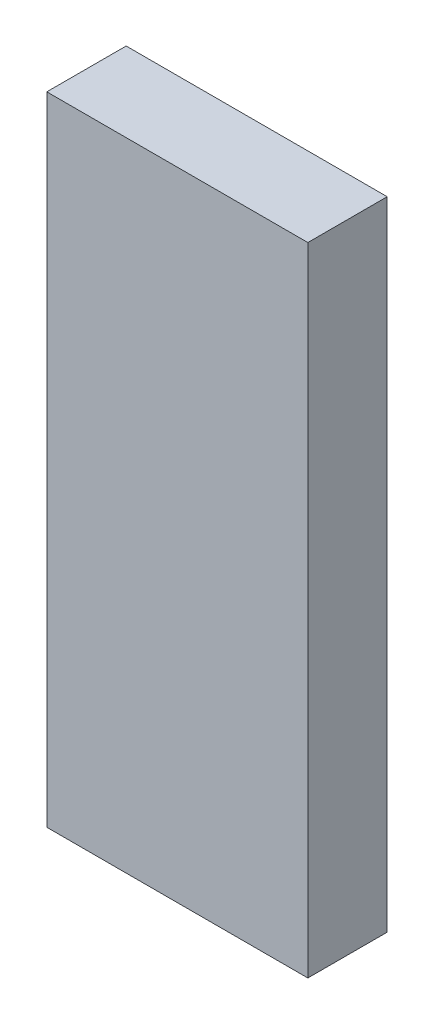
ISO-10303-21;
HEADER;
FILE_DESCRIPTION(('STEP AP214'),'2;1');
FILE_NAME('part.step','',(''),(''),'','','');
FILE_SCHEMA(('AUTOMOTIVE_DESIGN { 1 0 10303 214 1 1 1 1 }'));
ENDSEC;
DATA;
#1=APPLICATION_CONTEXT('core data for automotive mechanical design processes');
#2=APPLICATION_PROTOCOL_DEFINITION('international standard','automotive_design',2000,#1);
#3=PRODUCT_CONTEXT('',#1,'mechanical');
#4=PRODUCT('Part','Part','',(#3));
#5=PRODUCT_RELATED_PRODUCT_CATEGORY('part','',(#4));
#6=PRODUCT_DEFINITION_FORMATION('','',#4);
#7=PRODUCT_DEFINITION_CONTEXT('part definition',#1,'design');
#8=PRODUCT_DEFINITION('design','',#6,#7);
#9=PRODUCT_DEFINITION_SHAPE('','',#8);
#10=(LENGTH_UNIT() NAMED_UNIT(*) SI_UNIT(.MILLI.,.METRE.));
#11=(NAMED_UNIT(*) PLANE_ANGLE_UNIT() SI_UNIT($,.RADIAN.));
#12=(NAMED_UNIT(*) SI_UNIT($,.STERADIAN.) SOLID_ANGLE_UNIT());
#13=UNCERTAINTY_MEASURE_WITH_UNIT(LENGTH_MEASURE(1.E-05),#10,'distance_accuracy_value','');
#14=(GEOMETRIC_REPRESENTATION_CONTEXT(3) GLOBAL_UNCERTAINTY_ASSIGNED_CONTEXT((#13)) GLOBAL_UNIT_ASSIGNED_CONTEXT((#10,
#11,#12)) REPRESENTATION_CONTEXT('',''));
#15=CARTESIAN_POINT('',(0.,0.,0.));
#16=DIRECTION('',(0.,0.,1.));
#17=DIRECTION('',(1.,0.,0.));
#18=AXIS2_PLACEMENT_3D('',#15,#16,#17);
#19=CARTESIAN_POINT('',(0.62500002,1.52500076,0.38000178));
#20=DIRECTION('',(0.,0.,1.));
#21=DIRECTION('',(1.,0.,0.));
#22=AXIS2_PLACEMENT_3D('',#19,#20,#21);
#23=PLANE('',#22);
#24=DIRECTION('',(1.,0.,0.));
#25=VECTOR('',#24,1.);
#26=CARTESIAN_POINT('',(-0.62500002,1.52500076,0.38000178));
#27=LINE('',#26,#25);
#28=CARTESIAN_POINT('',(-0.62500002,1.52500076,0.38000178));
#29=VERTEX_POINT('',#28);
#30=CARTESIAN_POINT('',(0.62500002,1.52500076,0.38000178));
#31=VERTEX_POINT('',#30);
#32=EDGE_CURVE('E27',#29,#31,#27,.T.);
#33=ORIENTED_EDGE('',*,*,#32,.F.);
#34=DIRECTION('',(0.,1.,0.));
#35=VECTOR('',#34,1.);
#36=CARTESIAN_POINT('',(-0.62500002,-1.52499822,0.38000178));
#37=LINE('',#36,#35);
#38=CARTESIAN_POINT('',(-0.62500002,-1.52499822,0.38000178));
#39=VERTEX_POINT('',#38);
#40=EDGE_CURVE('E68',#39,#29,#37,.T.);
#41=ORIENTED_EDGE('',*,*,#40,.F.);
#42=DIRECTION('',(-1.,0.,0.));
#43=VECTOR('',#42,1.);
#44=CARTESIAN_POINT('',(0.62500002,-1.52499822,0.38000178));
#45=LINE('',#44,#43);
#46=CARTESIAN_POINT('',(0.62500002,-1.52499822,0.38000178));
#47=VERTEX_POINT('',#46);
#48=EDGE_CURVE('E71',#47,#39,#45,.T.);
#49=ORIENTED_EDGE('',*,*,#48,.F.);
#50=DIRECTION('',(0.,-1.,0.));
#51=VECTOR('',#50,1.);
#52=CARTESIAN_POINT('',(0.62500002,1.52500076,0.38000178));
#53=LINE('',#52,#51);
#54=EDGE_CURVE('E100',#31,#47,#53,.T.);
#55=ORIENTED_EDGE('',*,*,#54,.F.);
#56=EDGE_LOOP('',(#33,#41,#49,#55));
#57=FACE_BOUND('',#56,.T.);
#58=ADVANCED_FACE('F16',(#57),#23,.T.);
#59=CARTESIAN_POINT('',(0.62500002,1.52500076,0.));
#60=DIRECTION('',(0.,0.,1.));
#61=DIRECTION('',(1.,0.,0.));
#62=AXIS2_PLACEMENT_3D('',#59,#60,#61);
#63=PLANE('',#62);
#64=DIRECTION('',(0.,-1.,0.));
#65=VECTOR('',#64,1.);
#66=CARTESIAN_POINT('',(0.62500002,1.52500076,0.));
#67=LINE('',#66,#65);
#68=CARTESIAN_POINT('',(0.62500002,1.52500076,0.));
#69=VERTEX_POINT('',#68);
#70=CARTESIAN_POINT('',(0.62500002,-1.52499822,0.));
#71=VERTEX_POINT('',#70);
#72=EDGE_CURVE('E87',#69,#71,#67,.T.);
#73=ORIENTED_EDGE('',*,*,#72,.T.);
#74=DIRECTION('',(-1.,0.,0.));
#75=VECTOR('',#74,1.);
#76=CARTESIAN_POINT('',(0.62500002,-1.52499822,0.));
#77=LINE('',#76,#75);
#78=CARTESIAN_POINT('',(-0.62500002,-1.52499822,0.));
#79=VERTEX_POINT('',#78);
#80=EDGE_CURVE('E76',#71,#79,#77,.T.);
#81=ORIENTED_EDGE('',*,*,#80,.T.);
#82=DIRECTION('',(0.,1.,0.));
#83=VECTOR('',#82,1.);
#84=CARTESIAN_POINT('',(-0.62500002,-1.52499822,0.));
#85=LINE('',#84,#83);
#86=CARTESIAN_POINT('',(-0.62500002,1.52500076,0.));
#87=VERTEX_POINT('',#86);
#88=EDGE_CURVE('E20',#79,#87,#85,.T.);
#89=ORIENTED_EDGE('',*,*,#88,.T.);
#90=DIRECTION('',(1.,0.,0.));
#91=VECTOR('',#90,1.);
#92=CARTESIAN_POINT('',(-0.62500002,1.52500076,0.));
#93=LINE('',#92,#91);
#94=EDGE_CURVE('E10',#87,#69,#93,.T.);
#95=ORIENTED_EDGE('',*,*,#94,.T.);
#96=EDGE_LOOP('',(#73,#81,#89,#95));
#97=FACE_BOUND('',#96,.T.);
#98=ADVANCED_FACE('F122',(#97),#63,.F.);
#99=CARTESIAN_POINT('',(-0.62500002,1.52500076,0.));
#100=DIRECTION('',(0.,1.,0.));
#101=DIRECTION('',(1.,0.,0.));
#102=AXIS2_PLACEMENT_3D('',#99,#100,#101);
#103=PLANE('',#102);
#104=DIRECTION('',(0.,0.,1.));
#105=VECTOR('',#104,1.);
#106=CARTESIAN_POINT('',(-0.62500002,1.52500076,0.));
#107=LINE('',#106,#105);
#108=EDGE_CURVE('E75',#87,#29,#107,.T.);
#109=ORIENTED_EDGE('',*,*,#108,.T.);
#110=ORIENTED_EDGE('',*,*,#32,.T.);
#111=DIRECTION('',(0.,0.,1.));
#112=VECTOR('',#111,1.);
#113=CARTESIAN_POINT('',(0.62500002,1.52500076,0.));
#114=LINE('',#113,#112);
#115=EDGE_CURVE('E97',#69,#31,#114,.T.);
#116=ORIENTED_EDGE('',*,*,#115,.F.);
#117=ORIENTED_EDGE('',*,*,#94,.F.);
#118=EDGE_LOOP('',(#109,#110,#116,#117));
#119=FACE_BOUND('',#118,.T.);
#120=ADVANCED_FACE('F136',(#119),#103,.T.);
#121=CARTESIAN_POINT('',(-0.62500002,-1.52499822,0.));
#122=DIRECTION('',(-1.,0.,0.));
#123=DIRECTION('',(0.,0.,1.));
#124=AXIS2_PLACEMENT_3D('',#121,#122,#123);
#125=PLANE('',#124);
#126=DIRECTION('',(0.,0.,1.));
#127=VECTOR('',#126,1.);
#128=CARTESIAN_POINT('',(-0.62500002,-1.52499822,0.));
#129=LINE('',#128,#127);
#130=EDGE_CURVE('E79',#79,#39,#129,.T.);
#131=ORIENTED_EDGE('',*,*,#130,.T.);
#132=ORIENTED_EDGE('',*,*,#40,.T.);
#133=ORIENTED_EDGE('',*,*,#108,.F.);
#134=ORIENTED_EDGE('',*,*,#88,.F.);
#135=EDGE_LOOP('',(#131,#132,#133,#134));
#136=FACE_BOUND('',#135,.T.);
#137=ADVANCED_FACE('F18',(#136),#125,.T.);
#138=CARTESIAN_POINT('',(0.62500002,-1.52499822,0.));
#139=DIRECTION('',(0.,-1.,0.));
#140=DIRECTION('',(0.,0.,-1.));
#141=AXIS2_PLACEMENT_3D('',#138,#139,#140);
#142=PLANE('',#141);
#143=DIRECTION('',(0.,0.,1.));
#144=VECTOR('',#143,1.);
#145=CARTESIAN_POINT('',(0.62500002,-1.52499822,0.));
#146=LINE('',#145,#144);
#147=EDGE_CURVE('E84',#71,#47,#146,.T.);
#148=ORIENTED_EDGE('',*,*,#147,.T.);
#149=ORIENTED_EDGE('',*,*,#48,.T.);
#150=ORIENTED_EDGE('',*,*,#130,.F.);
#151=ORIENTED_EDGE('',*,*,#80,.F.);
#152=EDGE_LOOP('',(#148,#149,#150,#151));
#153=FACE_BOUND('',#152,.T.);
#154=ADVANCED_FACE('F82',(#153),#142,.T.);
#155=CARTESIAN_POINT('',(0.62500002,1.52500076,0.));
#156=DIRECTION('',(1.,0.,0.));
#157=DIRECTION('',(0.,1.,0.));
#158=AXIS2_PLACEMENT_3D('',#155,#156,#157);
#159=PLANE('',#158);
#160=ORIENTED_EDGE('',*,*,#115,.T.);
#161=ORIENTED_EDGE('',*,*,#54,.T.);
#162=ORIENTED_EDGE('',*,*,#147,.F.);
#163=ORIENTED_EDGE('',*,*,#72,.F.);
#164=EDGE_LOOP('',(#160,#161,#162,#163));
#165=FACE_BOUND('',#164,.T.);
#166=ADVANCED_FACE('F123',(#165),#159,.T.);
#167=CLOSED_SHELL('',(#58,#98,#120,#137,#154,#166));
#168=MANIFOLD_SOLID_BREP('B1',#167);
#169=ADVANCED_BREP_SHAPE_REPRESENTATION('',(#18,#168),#14);
#170=SHAPE_DEFINITION_REPRESENTATION(#9,#169);
ENDSEC;
END-ISO-10303-21;
